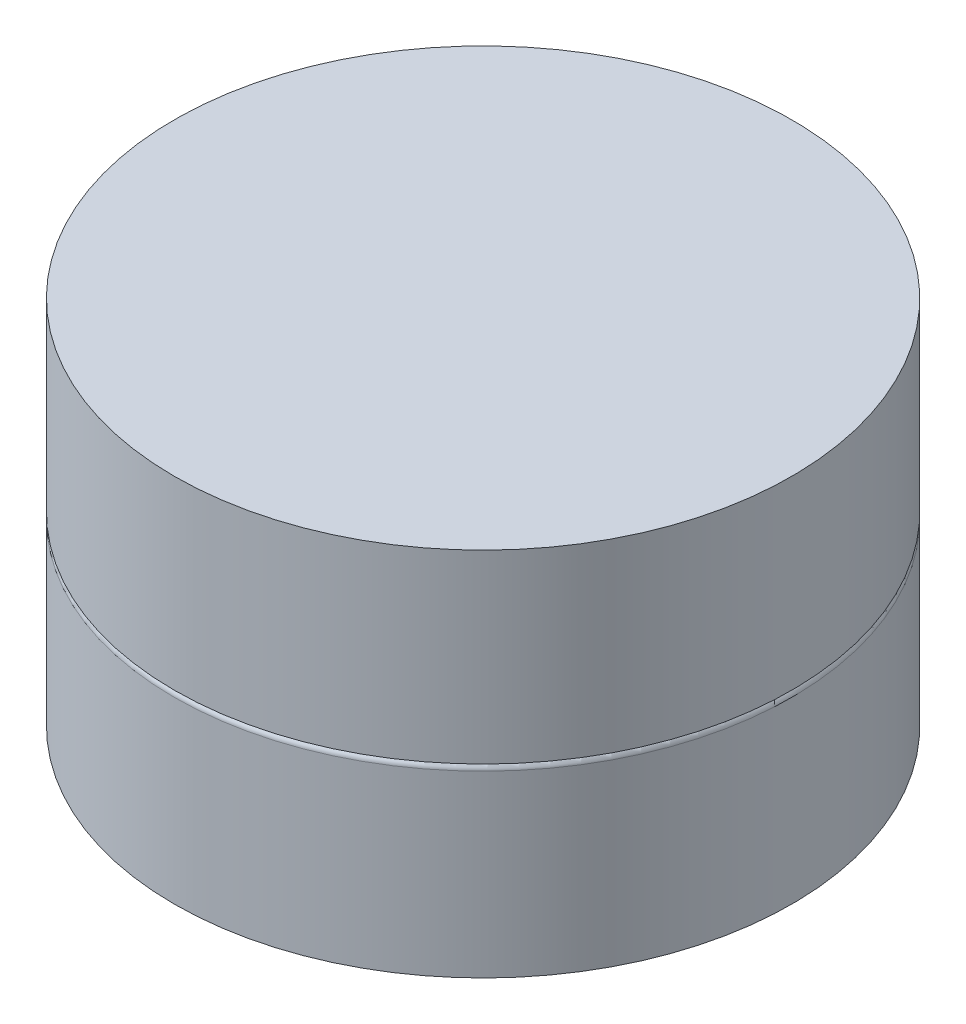
ISO-10303-21;
HEADER;
FILE_DESCRIPTION(('STEP AP214'),'2;1');
FILE_NAME('part.step','',(''),(''),'','','');
FILE_SCHEMA(('AUTOMOTIVE_DESIGN { 1 0 10303 214 1 1 1 1 }'));
ENDSEC;
DATA;
#1=APPLICATION_CONTEXT('core data for automotive mechanical design processes');
#2=APPLICATION_PROTOCOL_DEFINITION('international standard','automotive_design',2000,#1);
#3=PRODUCT_CONTEXT('',#1,'mechanical');
#4=PRODUCT('Part','Part','',(#3));
#5=PRODUCT_RELATED_PRODUCT_CATEGORY('part','',(#4));
#6=PRODUCT_DEFINITION_FORMATION('','',#4);
#7=PRODUCT_DEFINITION_CONTEXT('part definition',#1,'design');
#8=PRODUCT_DEFINITION('design','',#6,#7);
#9=PRODUCT_DEFINITION_SHAPE('','',#8);
#10=(LENGTH_UNIT() NAMED_UNIT(*) SI_UNIT(.MILLI.,.METRE.));
#11=(NAMED_UNIT(*) PLANE_ANGLE_UNIT() SI_UNIT($,.RADIAN.));
#12=(NAMED_UNIT(*) SI_UNIT($,.STERADIAN.) SOLID_ANGLE_UNIT());
#13=UNCERTAINTY_MEASURE_WITH_UNIT(LENGTH_MEASURE(1.E-05),#10,'distance_accuracy_value','');
#14=(GEOMETRIC_REPRESENTATION_CONTEXT(3) GLOBAL_UNCERTAINTY_ASSIGNED_CONTEXT((#13)) GLOBAL_UNIT_ASSIGNED_CONTEXT((#10,
#11,#12)) REPRESENTATION_CONTEXT('',''));
#15=CARTESIAN_POINT('',(0.,0.,0.));
#16=DIRECTION('',(0.,0.,1.));
#17=DIRECTION('',(1.,0.,0.));
#18=AXIS2_PLACEMENT_3D('',#15,#16,#17);
#19=CARTESIAN_POINT('',(0.,1.5,0.));
#20=DIRECTION('',(0.,-1.,0.));
#21=DIRECTION('',(0.,0.,-1.));
#22=AXIS2_PLACEMENT_3D('',#19,#20,#21);
#23=CYLINDRICAL_SURFACE('',#22,2.5);
#24=CARTESIAN_POINT('',(0.,1.45,0.));
#25=DIRECTION('',(0.,1.,0.));
#26=DIRECTION('',(0.,0.,1.));
#27=AXIS2_PLACEMENT_3D('',#24,#25,#26);
#28=CIRCLE('',#27,2.5);
#29=CARTESIAN_POINT('',(0.,1.45,2.5));
#30=VERTEX_POINT('',#29);
#31=EDGE_CURVE('E10',#30,#30,#28,.F.);
#32=ORIENTED_EDGE('',*,*,#31,.T.);
#33=EDGE_LOOP('',(#32));
#34=FACE_BOUND('',#33,.T.);
#35=CARTESIAN_POINT('',(0.,0.,0.));
#36=DIRECTION('',(0.,1.,0.));
#37=DIRECTION('',(0.,0.,1.));
#38=AXIS2_PLACEMENT_3D('',#35,#36,#37);
#39=CIRCLE('',#38,2.5);
#40=CARTESIAN_POINT('',(0.,0.,2.5));
#41=VERTEX_POINT('',#40);
#42=EDGE_CURVE('E42',#41,#41,#39,.T.);
#43=ORIENTED_EDGE('',*,*,#42,.T.);
#44=EDGE_LOOP('',(#43));
#45=FACE_BOUND('',#44,.T.);
#46=ADVANCED_FACE('F31',(#34,#45),#23,.T.);
#47=CARTESIAN_POINT('',(0.,0.,0.));
#48=DIRECTION('',(0.,1.,0.));
#49=DIRECTION('',(0.,0.,1.));
#50=AXIS2_PLACEMENT_3D('',#47,#48,#49);
#51=PLANE('',#50);
#52=ORIENTED_EDGE('',*,*,#42,.F.);
#53=EDGE_LOOP('',(#52));
#54=FACE_BOUND('',#53,.T.);
#55=ADVANCED_FACE('F71',(#54),#51,.F.);
#56=CARTESIAN_POINT('',(0.,1.45,0.));
#57=DIRECTION('',(0.,1.,0.));
#58=DIRECTION('',(0.,0.,1.));
#59=AXIS2_PLACEMENT_3D('',#56,#57,#58);
#60=TOROIDAL_SURFACE('',#59,2.45,0.05);
#61=ORIENTED_EDGE('',*,*,#31,.F.);
#62=EDGE_LOOP('',(#61));
#63=FACE_BOUND('',#62,.T.);
#64=CARTESIAN_POINT('',(0.,1.5,0.));
#65=DIRECTION('',(0.,1.,0.));
#66=DIRECTION('',(0.,0.,1.));
#67=AXIS2_PLACEMENT_3D('',#64,#65,#66);
#68=CIRCLE('',#67,2.45);
#69=CARTESIAN_POINT('',(0.,1.5,2.45));
#70=VERTEX_POINT('',#69);
#71=EDGE_CURVE('E38',#70,#70,#68,.T.);
#72=ORIENTED_EDGE('',*,*,#71,.F.);
#73=EDGE_LOOP('',(#72));
#74=FACE_BOUND('',#73,.T.);
#75=ADVANCED_FACE('F33',(#63,#74),#60,.T.);
#76=CARTESIAN_POINT('',(0.,3.,0.));
#77=DIRECTION('',(0.,-1.,0.));
#78=DIRECTION('',(0.,0.,-1.));
#79=AXIS2_PLACEMENT_3D('',#76,#77,#78);
#80=CYLINDRICAL_SURFACE('',#79,2.5);
#81=CARTESIAN_POINT('',(0.,3.,0.));
#82=DIRECTION('',(0.,1.,0.));
#83=DIRECTION('',(0.,0.,1.));
#84=AXIS2_PLACEMENT_3D('',#81,#82,#83);
#85=CIRCLE('',#84,2.5);
#86=CARTESIAN_POINT('',(0.,3.,2.5));
#87=VERTEX_POINT('',#86);
#88=EDGE_CURVE('E46',#87,#87,#85,.T.);
#89=ORIENTED_EDGE('',*,*,#88,.F.);
#90=EDGE_LOOP('',(#89));
#91=FACE_BOUND('',#90,.T.);
#92=CARTESIAN_POINT('',(0.,1.5,0.));
#93=DIRECTION('',(0.,1.,0.));
#94=DIRECTION('',(0.,0.,1.));
#95=AXIS2_PLACEMENT_3D('',#92,#93,#94);
#96=CIRCLE('',#95,2.5);
#97=CARTESIAN_POINT('',(0.,1.5,2.5));
#98=VERTEX_POINT('',#97);
#99=EDGE_CURVE('E49',#98,#98,#96,.T.);
#100=ORIENTED_EDGE('',*,*,#99,.T.);
#101=EDGE_LOOP('',(#100));
#102=FACE_BOUND('',#101,.T.);
#103=ADVANCED_FACE('F57',(#91,#102),#80,.T.);
#104=CARTESIAN_POINT('',(0.,3.,0.));
#105=DIRECTION('',(0.,1.,0.));
#106=DIRECTION('',(0.,0.,1.));
#107=AXIS2_PLACEMENT_3D('',#104,#105,#106);
#108=PLANE('',#107);
#109=ORIENTED_EDGE('',*,*,#88,.T.);
#110=EDGE_LOOP('',(#109));
#111=FACE_BOUND('',#110,.T.);
#112=ADVANCED_FACE('F55',(#111),#108,.T.);
#113=CARTESIAN_POINT('',(0.,1.5,0.));
#114=DIRECTION('',(0.,1.,0.));
#115=DIRECTION('',(0.,0.,1.));
#116=AXIS2_PLACEMENT_3D('',#113,#114,#115);
#117=PLANE('',#116);
#118=ORIENTED_EDGE('',*,*,#71,.T.);
#119=EDGE_LOOP('',(#118));
#120=FACE_BOUND('',#119,.T.);
#121=ORIENTED_EDGE('',*,*,#99,.F.);
#122=EDGE_LOOP('',(#121));
#123=FACE_BOUND('',#122,.T.);
#124=ADVANCED_FACE('F63',(#120,#123),#117,.F.);
#125=CLOSED_SHELL('',(#46,#55,#75,#103,#112,#124));
#126=MANIFOLD_SOLID_BREP('B2',#125);
#127=ADVANCED_BREP_SHAPE_REPRESENTATION('',(#18,#126),#14);
#128=SHAPE_DEFINITION_REPRESENTATION(#9,#127);
ENDSEC;
END-ISO-10303-21;
